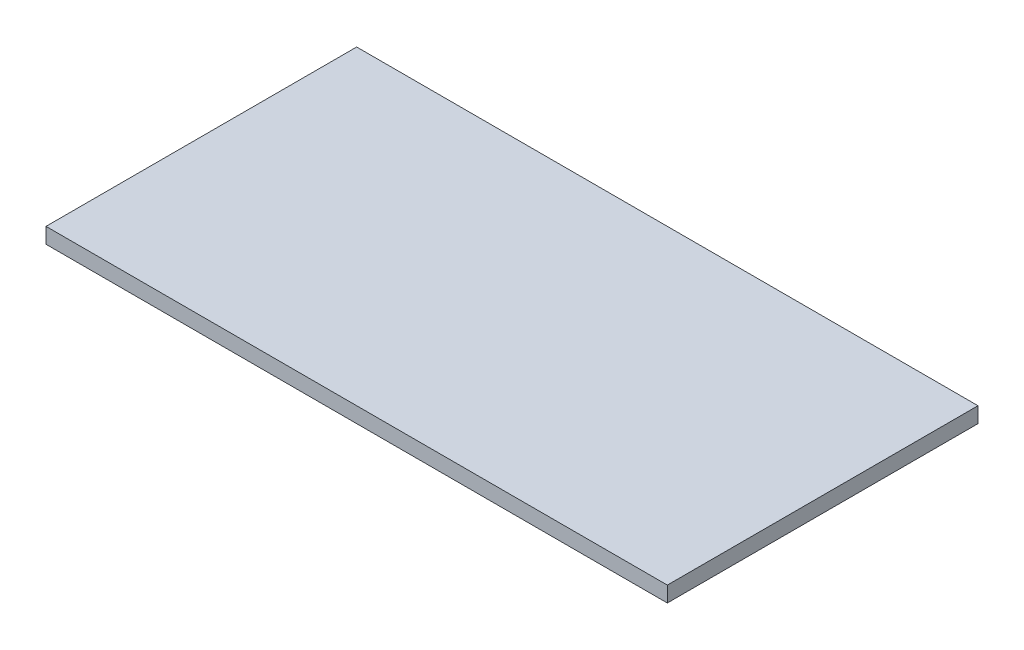
ISO-10303-21;
HEADER;
FILE_DESCRIPTION(('STEP AP214'),'2;1');
FILE_NAME('part.step','',(''),(''),'','','');
FILE_SCHEMA(('AUTOMOTIVE_DESIGN { 1 0 10303 214 1 1 1 1 }'));
ENDSEC;
DATA;
#1=APPLICATION_CONTEXT('core data for automotive mechanical design processes');
#2=APPLICATION_PROTOCOL_DEFINITION('international standard','automotive_design',2000,#1);
#3=PRODUCT_CONTEXT('',#1,'mechanical');
#4=PRODUCT('Part','Part','',(#3));
#5=PRODUCT_RELATED_PRODUCT_CATEGORY('part','',(#4));
#6=PRODUCT_DEFINITION_FORMATION('','',#4);
#7=PRODUCT_DEFINITION_CONTEXT('part definition',#1,'design');
#8=PRODUCT_DEFINITION('design','',#6,#7);
#9=PRODUCT_DEFINITION_SHAPE('','',#8);
#10=(LENGTH_UNIT() NAMED_UNIT(*) SI_UNIT(.MILLI.,.METRE.));
#11=(NAMED_UNIT(*) PLANE_ANGLE_UNIT() SI_UNIT($,.RADIAN.));
#12=(NAMED_UNIT(*) SI_UNIT($,.STERADIAN.) SOLID_ANGLE_UNIT());
#13=UNCERTAINTY_MEASURE_WITH_UNIT(LENGTH_MEASURE(1.E-05),#10,'distance_accuracy_value','');
#14=(GEOMETRIC_REPRESENTATION_CONTEXT(3) GLOBAL_UNCERTAINTY_ASSIGNED_CONTEXT((#13)) GLOBAL_UNIT_ASSIGNED_CONTEXT((#10,
#11,#12)) REPRESENTATION_CONTEXT('',''));
#15=CARTESIAN_POINT('',(0.,0.,0.));
#16=DIRECTION('',(0.,0.,1.));
#17=DIRECTION('',(1.,0.,0.));
#18=AXIS2_PLACEMENT_3D('',#15,#16,#17);
#19=CARTESIAN_POINT('',(-127.,6.35,63.5));
#20=DIRECTION('',(1.,0.,0.));
#21=DIRECTION('',(0.,0.,-1.));
#22=AXIS2_PLACEMENT_3D('',#19,#20,#21);
#23=PLANE('',#22);
#24=DIRECTION('',(0.,0.,1.));
#25=VECTOR('',#24,1.);
#26=CARTESIAN_POINT('',(-127.,0.,63.5));
#27=LINE('',#26,#25);
#28=CARTESIAN_POINT('',(-127.,0.,-63.5));
#29=VERTEX_POINT('',#28);
#30=CARTESIAN_POINT('',(-127.,0.,63.5));
#31=VERTEX_POINT('',#30);
#32=EDGE_CURVE('E100',#29,#31,#27,.T.);
#33=ORIENTED_EDGE('',*,*,#32,.T.);
#34=DIRECTION('',(0.,-1.,0.));
#35=VECTOR('',#34,1.);
#36=CARTESIAN_POINT('',(-127.,6.35,63.5));
#37=LINE('',#36,#35);
#38=CARTESIAN_POINT('',(-127.,6.35,63.5));
#39=VERTEX_POINT('',#38);
#40=EDGE_CURVE('E11',#39,#31,#37,.T.);
#41=ORIENTED_EDGE('',*,*,#40,.F.);
#42=DIRECTION('',(0.,0.,1.));
#43=VECTOR('',#42,1.);
#44=CARTESIAN_POINT('',(-127.,6.35,63.5));
#45=LINE('',#44,#43);
#46=CARTESIAN_POINT('',(-127.,6.35,-63.5));
#47=VERTEX_POINT('',#46);
#48=EDGE_CURVE('E88',#47,#39,#45,.T.);
#49=ORIENTED_EDGE('',*,*,#48,.F.);
#50=DIRECTION('',(0.,-1.,0.));
#51=VECTOR('',#50,1.);
#52=CARTESIAN_POINT('',(-127.,6.35,-63.5));
#53=LINE('',#52,#51);
#54=EDGE_CURVE('E96',#47,#29,#53,.T.);
#55=ORIENTED_EDGE('',*,*,#54,.T.);
#56=EDGE_LOOP('',(#33,#41,#49,#55));
#57=FACE_BOUND('',#56,.T.);
#58=ADVANCED_FACE('F37',(#57),#23,.F.);
#59=CARTESIAN_POINT('',(127.,6.35,63.5));
#60=DIRECTION('',(0.,0.,-1.));
#61=DIRECTION('',(-1.,0.,0.));
#62=AXIS2_PLACEMENT_3D('',#59,#60,#61);
#63=PLANE('',#62);
#64=DIRECTION('',(1.,0.,0.));
#65=VECTOR('',#64,1.);
#66=CARTESIAN_POINT('',(127.,0.,63.5));
#67=LINE('',#66,#65);
#68=CARTESIAN_POINT('',(127.,0.,63.5));
#69=VERTEX_POINT('',#68);
#70=EDGE_CURVE('E92',#31,#69,#67,.T.);
#71=ORIENTED_EDGE('',*,*,#70,.T.);
#72=DIRECTION('',(0.,-1.,0.));
#73=VECTOR('',#72,1.);
#74=CARTESIAN_POINT('',(127.,6.35,63.5));
#75=LINE('',#74,#73);
#76=CARTESIAN_POINT('',(127.,6.35,63.5));
#77=VERTEX_POINT('',#76);
#78=EDGE_CURVE('E45',#77,#69,#75,.T.);
#79=ORIENTED_EDGE('',*,*,#78,.F.);
#80=DIRECTION('',(1.,0.,0.));
#81=VECTOR('',#80,1.);
#82=CARTESIAN_POINT('',(127.,6.35,63.5));
#83=LINE('',#82,#81);
#84=EDGE_CURVE('E83',#39,#77,#83,.T.);
#85=ORIENTED_EDGE('',*,*,#84,.F.);
#86=ORIENTED_EDGE('',*,*,#40,.T.);
#87=EDGE_LOOP('',(#71,#79,#85,#86));
#88=FACE_BOUND('',#87,.T.);
#89=ADVANCED_FACE('F91',(#88),#63,.F.);
#90=CARTESIAN_POINT('',(127.,6.35,63.5));
#91=DIRECTION('',(-1.,0.,0.));
#92=DIRECTION('',(0.,0.,1.));
#93=AXIS2_PLACEMENT_3D('',#90,#91,#92);
#94=PLANE('',#93);
#95=DIRECTION('',(0.,0.,-1.));
#96=VECTOR('',#95,1.);
#97=CARTESIAN_POINT('',(127.,0.,63.5));
#98=LINE('',#97,#96);
#99=CARTESIAN_POINT('',(127.,0.,-63.5));
#100=VERTEX_POINT('',#99);
#101=EDGE_CURVE('E70',#69,#100,#98,.T.);
#102=ORIENTED_EDGE('',*,*,#101,.T.);
#103=DIRECTION('',(0.,-1.,0.));
#104=VECTOR('',#103,1.);
#105=CARTESIAN_POINT('',(127.,6.35,-63.5));
#106=LINE('',#105,#104);
#107=CARTESIAN_POINT('',(127.,6.35,-63.5));
#108=VERTEX_POINT('',#107);
#109=EDGE_CURVE('E93',#108,#100,#106,.T.);
#110=ORIENTED_EDGE('',*,*,#109,.F.);
#111=DIRECTION('',(0.,0.,-1.));
#112=VECTOR('',#111,1.);
#113=CARTESIAN_POINT('',(127.,6.35,63.5));
#114=LINE('',#113,#112);
#115=EDGE_CURVE('E86',#77,#108,#114,.T.);
#116=ORIENTED_EDGE('',*,*,#115,.F.);
#117=ORIENTED_EDGE('',*,*,#78,.T.);
#118=EDGE_LOOP('',(#102,#110,#116,#117));
#119=FACE_BOUND('',#118,.T.);
#120=ADVANCED_FACE('F94',(#119),#94,.F.);
#121=CARTESIAN_POINT('',(127.,6.35,-63.5));
#122=DIRECTION('',(0.,0.,1.));
#123=DIRECTION('',(1.,0.,0.));
#124=AXIS2_PLACEMENT_3D('',#121,#122,#123);
#125=PLANE('',#124);
#126=DIRECTION('',(-1.,0.,0.));
#127=VECTOR('',#126,1.);
#128=CARTESIAN_POINT('',(127.,0.,-63.5));
#129=LINE('',#128,#127);
#130=EDGE_CURVE('E76',#100,#29,#129,.T.);
#131=ORIENTED_EDGE('',*,*,#130,.T.);
#132=ORIENTED_EDGE('',*,*,#54,.F.);
#133=DIRECTION('',(-1.,0.,0.));
#134=VECTOR('',#133,1.);
#135=CARTESIAN_POINT('',(127.,6.35,-63.5));
#136=LINE('',#135,#134);
#137=EDGE_CURVE('E53',#108,#47,#136,.T.);
#138=ORIENTED_EDGE('',*,*,#137,.F.);
#139=ORIENTED_EDGE('',*,*,#109,.T.);
#140=EDGE_LOOP('',(#131,#132,#138,#139));
#141=FACE_BOUND('',#140,.T.);
#142=ADVANCED_FACE('F107',(#141),#125,.F.);
#143=CARTESIAN_POINT('',(0.,6.35,0.));
#144=DIRECTION('',(0.,1.,0.));
#145=DIRECTION('',(0.,0.,1.));
#146=AXIS2_PLACEMENT_3D('',#143,#144,#145);
#147=PLANE('',#146);
#148=ORIENTED_EDGE('',*,*,#48,.T.);
#149=ORIENTED_EDGE('',*,*,#84,.T.);
#150=ORIENTED_EDGE('',*,*,#115,.T.);
#151=ORIENTED_EDGE('',*,*,#137,.T.);
#152=EDGE_LOOP('',(#148,#149,#150,#151));
#153=FACE_BOUND('',#152,.T.);
#154=ADVANCED_FACE('F84',(#153),#147,.T.);
#155=CARTESIAN_POINT('',(0.,0.,0.));
#156=DIRECTION('',(0.,1.,0.));
#157=DIRECTION('',(0.,0.,1.));
#158=AXIS2_PLACEMENT_3D('',#155,#156,#157);
#159=PLANE('',#158);
#160=ORIENTED_EDGE('',*,*,#32,.F.);
#161=ORIENTED_EDGE('',*,*,#130,.F.);
#162=ORIENTED_EDGE('',*,*,#101,.F.);
#163=ORIENTED_EDGE('',*,*,#70,.F.);
#164=EDGE_LOOP('',(#160,#161,#162,#163));
#165=FACE_BOUND('',#164,.T.);
#166=ADVANCED_FACE('F110',(#165),#159,.F.);
#167=CLOSED_SHELL('',(#58,#89,#120,#142,#154,#166));
#168=MANIFOLD_SOLID_BREP('B2',#167);
#169=ADVANCED_BREP_SHAPE_REPRESENTATION('',(#18,#168),#14);
#170=SHAPE_DEFINITION_REPRESENTATION(#9,#169);
ENDSEC;
END-ISO-10303-21;
